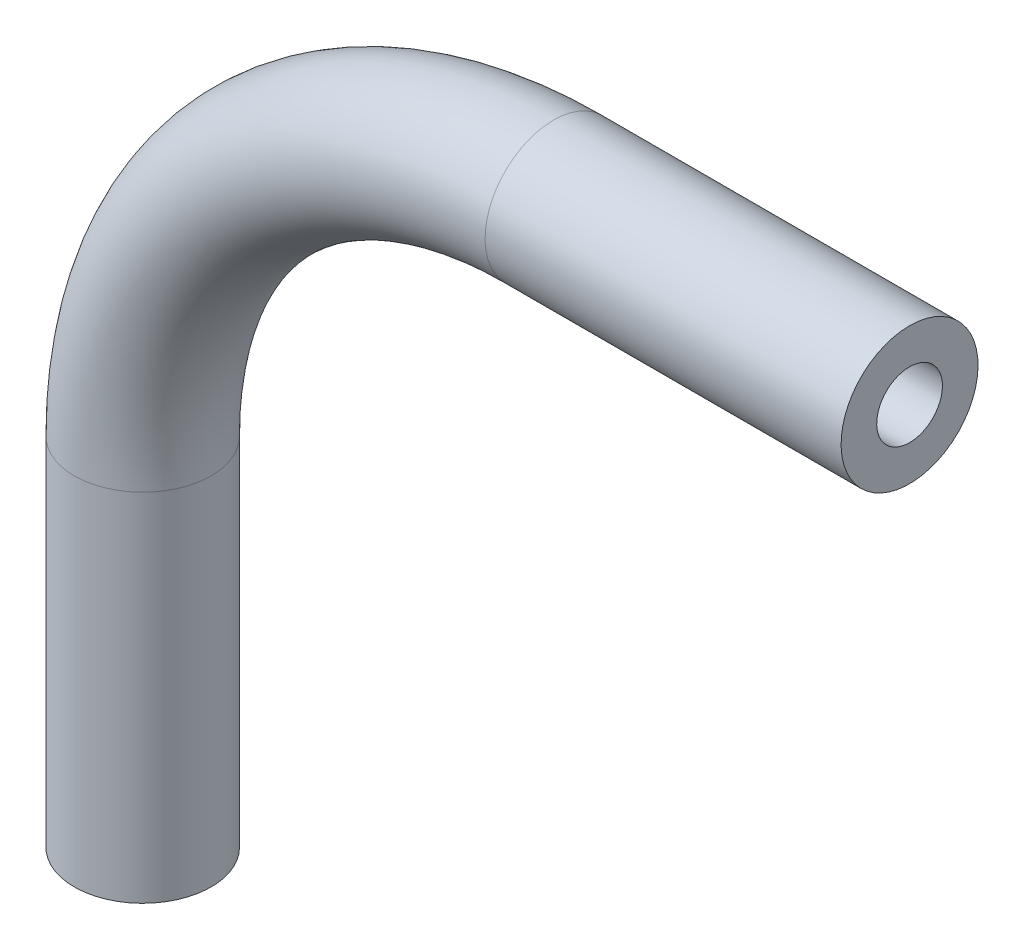
ISO-10303-21;
HEADER;
FILE_DESCRIPTION(('STEP AP214'),'2;1');
FILE_NAME('part.step','',(''),(''),'','','');
FILE_SCHEMA(('AUTOMOTIVE_DESIGN { 1 0 10303 214 1 1 1 1 }'));
ENDSEC;
DATA;
#1=APPLICATION_CONTEXT('core data for automotive mechanical design processes');
#2=APPLICATION_PROTOCOL_DEFINITION('international standard','automotive_design',2000,#1);
#3=PRODUCT_CONTEXT('',#1,'mechanical');
#4=PRODUCT('Part','Part','',(#3));
#5=PRODUCT_RELATED_PRODUCT_CATEGORY('part','',(#4));
#6=PRODUCT_DEFINITION_FORMATION('','',#4);
#7=PRODUCT_DEFINITION_CONTEXT('part definition',#1,'design');
#8=PRODUCT_DEFINITION('design','',#6,#7);
#9=PRODUCT_DEFINITION_SHAPE('','',#8);
#10=(LENGTH_UNIT() NAMED_UNIT(*) SI_UNIT(.MILLI.,.METRE.));
#11=(NAMED_UNIT(*) PLANE_ANGLE_UNIT() SI_UNIT($,.RADIAN.));
#12=(NAMED_UNIT(*) SI_UNIT($,.STERADIAN.) SOLID_ANGLE_UNIT());
#13=UNCERTAINTY_MEASURE_WITH_UNIT(LENGTH_MEASURE(1.E-05),#10,'distance_accuracy_value','');
#14=(GEOMETRIC_REPRESENTATION_CONTEXT(3) GLOBAL_UNCERTAINTY_ASSIGNED_CONTEXT((#13)) GLOBAL_UNIT_ASSIGNED_CONTEXT((#10,
#11,#12)) REPRESENTATION_CONTEXT('',''));
#15=CARTESIAN_POINT('',(0.,0.,0.));
#16=DIRECTION('',(0.,0.,1.));
#17=DIRECTION('',(1.,0.,0.));
#18=AXIS2_PLACEMENT_3D('',#15,#16,#17);
#19=CARTESIAN_POINT('',(0.,-18.0323178807946,0.));
#20=DIRECTION('',(0.,1.,0.));
#21=DIRECTION('',(-1.,0.,0.));
#22=AXIS2_PLACEMENT_3D('',#19,#20,#21);
#23=CYLINDRICAL_SURFACE('',#22,3.175);
#24=CARTESIAN_POINT('',(0.,-1.52231788079484,0.));
#25=DIRECTION('',(0.,1.,0.));
#26=DIRECTION('',(-1.,0.,0.));
#27=AXIS2_PLACEMENT_3D('',#24,#25,#26);
#28=CIRCLE('',#27,3.175);
#29=CARTESIAN_POINT('',(-3.175,-1.52231788079487,0.));
#30=VERTEX_POINT('',#29);
#31=EDGE_CURVE('E80',#30,#30,#28,.T.);
#32=ORIENTED_EDGE('',*,*,#31,.F.);
#33=EDGE_LOOP('',(#32));
#34=FACE_BOUND('',#33,.T.);
#35=CARTESIAN_POINT('',(0.,-18.0323178807946,0.));
#36=DIRECTION('',(0.,1.,0.));
#37=DIRECTION('',(-1.,0.,0.));
#38=AXIS2_PLACEMENT_3D('',#35,#36,#37);
#39=CIRCLE('',#38,3.175);
#40=CARTESIAN_POINT('',(-3.175,-18.0323178807946,0.));
#41=VERTEX_POINT('',#40);
#42=EDGE_CURVE('E49',#41,#41,#39,.T.);
#43=ORIENTED_EDGE('',*,*,#42,.T.);
#44=EDGE_LOOP('',(#43));
#45=FACE_BOUND('',#44,.T.);
#46=ADVANCED_FACE('F34',(#34,#45),#23,.T.);
#47=CARTESIAN_POINT('',(19.05,-1.52231788079469,0.));
#48=DIRECTION('',(0.,0.,-1.));
#49=DIRECTION('',(-1.,0.,0.));
#50=AXIS2_PLACEMENT_3D('',#47,#48,#49);
#51=TOROIDAL_SURFACE('',#50,19.05,3.175);
#52=CARTESIAN_POINT('',(19.0500000000001,17.5276821192053,0.));
#53=DIRECTION('',(1.,0.,0.));
#54=DIRECTION('',(0.,1.,0.));
#55=AXIS2_PLACEMENT_3D('',#52,#53,#54);
#56=CIRCLE('',#55,3.175);
#57=CARTESIAN_POINT('',(19.0500000000001,20.7026821192053,0.));
#58=VERTEX_POINT('',#57);
#59=EDGE_CURVE('E38',#58,#58,#56,.T.);
#60=CARTESIAN_POINT('',(19.05,-1.52231788079469,0.));
#61=DIRECTION('',(0.,0.,-1.));
#62=DIRECTION('',(-1.,0.,0.));
#63=AXIS2_PLACEMENT_3D('',#60,#61,#62);
#64=CIRCLE('',#63,22.225);
#65=EDGE_CURVE('',#30,#58,#64,.T.);
#66=ORIENTED_EDGE('',*,*,#31,.T.);
#67=ORIENTED_EDGE('',*,*,#59,.F.);
#68=ORIENTED_EDGE('',*,*,#65,.T.);
#69=ORIENTED_EDGE('',*,*,#65,.F.);
#70=EDGE_LOOP('',(#66,#68,#67,#69));
#71=FACE_BOUND('',#70,.T.);
#72=ADVANCED_FACE('F88',(#71),#51,.T.);
#73=CARTESIAN_POINT('',(19.0500000000001,17.5276821192053,0.));
#74=DIRECTION('',(1.,0.,0.));
#75=DIRECTION('',(0.,1.,0.));
#76=AXIS2_PLACEMENT_3D('',#73,#74,#75);
#77=CYLINDRICAL_SURFACE('',#76,3.175);
#78=CARTESIAN_POINT('',(35.56,17.5276821192053,0.));
#79=DIRECTION('',(1.,0.,0.));
#80=DIRECTION('',(0.,1.,0.));
#81=AXIS2_PLACEMENT_3D('',#78,#79,#80);
#82=CIRCLE('',#81,3.175);
#83=CARTESIAN_POINT('',(35.56,20.7026821192053,0.));
#84=VERTEX_POINT('',#83);
#85=EDGE_CURVE('E54',#84,#84,#82,.T.);
#86=ORIENTED_EDGE('',*,*,#85,.F.);
#87=EDGE_LOOP('',(#86));
#88=FACE_BOUND('',#87,.T.);
#89=ORIENTED_EDGE('',*,*,#59,.T.);
#90=EDGE_LOOP('',(#89));
#91=FACE_BOUND('',#90,.T.);
#92=ADVANCED_FACE('F36',(#88,#91),#77,.T.);
#93=CARTESIAN_POINT('',(0.,-18.0323178807946,0.));
#94=DIRECTION('',(0.,1.,0.));
#95=DIRECTION('',(-1.,0.,0.));
#96=AXIS2_PLACEMENT_3D('',#93,#94,#95);
#97=PLANE('',#96);
#98=CARTESIAN_POINT('',(0.,-18.0323178807946,0.));
#99=DIRECTION('',(0.,1.,0.));
#100=DIRECTION('',(-1.,0.,0.));
#101=AXIS2_PLACEMENT_3D('',#98,#99,#100);
#102=CIRCLE('',#101,1.524);
#103=CARTESIAN_POINT('',(-1.524,-18.0323178807946,0.));
#104=VERTEX_POINT('',#103);
#105=EDGE_CURVE('E75',#104,#104,#102,.F.);
#106=ORIENTED_EDGE('',*,*,#105,.F.);
#107=EDGE_LOOP('',(#106));
#108=FACE_BOUND('',#107,.T.);
#109=ORIENTED_EDGE('',*,*,#42,.F.);
#110=EDGE_LOOP('',(#109));
#111=FACE_BOUND('',#110,.T.);
#112=ADVANCED_FACE('F94',(#108,#111),#97,.F.);
#113=CARTESIAN_POINT('',(35.56,17.5276821192053,0.));
#114=DIRECTION('',(1.,0.,0.));
#115=DIRECTION('',(0.,1.,0.));
#116=AXIS2_PLACEMENT_3D('',#113,#114,#115);
#117=PLANE('',#116);
#118=CARTESIAN_POINT('',(35.56,17.5276821192053,0.));
#119=DIRECTION('',(1.,0.,0.));
#120=DIRECTION('',(0.,1.,0.));
#121=AXIS2_PLACEMENT_3D('',#118,#119,#120);
#122=CIRCLE('',#121,1.524);
#123=CARTESIAN_POINT('',(35.56,19.0516821192053,0.));
#124=VERTEX_POINT('',#123);
#125=EDGE_CURVE('E11',#124,#124,#122,.F.);
#126=ORIENTED_EDGE('',*,*,#125,.T.);
#127=EDGE_LOOP('',(#126));
#128=FACE_BOUND('',#127,.T.);
#129=ORIENTED_EDGE('',*,*,#85,.T.);
#130=EDGE_LOOP('',(#129));
#131=FACE_BOUND('',#130,.T.);
#132=ADVANCED_FACE('F61',(#128,#131),#117,.T.);
#133=CARTESIAN_POINT('',(0.,-18.0323178807946,0.));
#134=DIRECTION('',(0.,1.,0.));
#135=DIRECTION('',(-1.,0.,0.));
#136=AXIS2_PLACEMENT_3D('',#133,#134,#135);
#137=CYLINDRICAL_SURFACE('',#136,1.524);
#138=CARTESIAN_POINT('',(0.,-1.52231788079484,0.));
#139=DIRECTION('',(0.,1.,0.));
#140=DIRECTION('',(-1.,0.,0.));
#141=AXIS2_PLACEMENT_3D('',#138,#139,#140);
#142=CIRCLE('',#141,1.524);
#143=CARTESIAN_POINT('',(-1.524,-1.52231788079485,0.));
#144=VERTEX_POINT('',#143);
#145=EDGE_CURVE('E72',#144,#144,#142,.F.);
#146=ORIENTED_EDGE('',*,*,#145,.F.);
#147=EDGE_LOOP('',(#146));
#148=FACE_BOUND('',#147,.T.);
#149=ORIENTED_EDGE('',*,*,#105,.T.);
#150=EDGE_LOOP('',(#149));
#151=FACE_BOUND('',#150,.T.);
#152=ADVANCED_FACE('F102',(#148,#151),#137,.F.);
#153=CARTESIAN_POINT('',(19.05,-1.52231788079469,0.));
#154=DIRECTION('',(0.,0.,-1.));
#155=DIRECTION('',(-1.,0.,0.));
#156=AXIS2_PLACEMENT_3D('',#153,#154,#155);
#157=TOROIDAL_SURFACE('',#156,19.05,1.524);
#158=CARTESIAN_POINT('',(19.0500000000001,17.5276821192053,0.));
#159=DIRECTION('',(1.,0.,0.));
#160=DIRECTION('',(0.,1.,0.));
#161=AXIS2_PLACEMENT_3D('',#158,#159,#160);
#162=CIRCLE('',#161,1.524);
#163=CARTESIAN_POINT('',(19.0500000000001,19.0516821192053,0.));
#164=VERTEX_POINT('',#163);
#165=EDGE_CURVE('E43',#164,#164,#162,.F.);
#166=CARTESIAN_POINT('',(19.05,-1.52231788079469,0.));
#167=DIRECTION('',(0.,0.,-1.));
#168=DIRECTION('',(-1.,0.,0.));
#169=AXIS2_PLACEMENT_3D('',#166,#167,#168);
#170=CIRCLE('',#169,20.574);
#171=EDGE_CURVE('',#144,#164,#170,.T.);
#172=ORIENTED_EDGE('',*,*,#145,.T.);
#173=ORIENTED_EDGE('',*,*,#165,.F.);
#174=ORIENTED_EDGE('',*,*,#171,.T.);
#175=ORIENTED_EDGE('',*,*,#171,.F.);
#176=EDGE_LOOP('',(#172,#174,#173,#175));
#177=FACE_BOUND('',#176,.T.);
#178=ADVANCED_FACE('F67',(#177),#157,.F.);
#179=CARTESIAN_POINT('',(19.0500000000001,17.5276821192053,0.));
#180=DIRECTION('',(1.,0.,0.));
#181=DIRECTION('',(0.,1.,0.));
#182=AXIS2_PLACEMENT_3D('',#179,#180,#181);
#183=CYLINDRICAL_SURFACE('',#182,1.524);
#184=ORIENTED_EDGE('',*,*,#125,.F.);
#185=EDGE_LOOP('',(#184));
#186=FACE_BOUND('',#185,.T.);
#187=ORIENTED_EDGE('',*,*,#165,.T.);
#188=EDGE_LOOP('',(#187));
#189=FACE_BOUND('',#188,.T.);
#190=ADVANCED_FACE('F64',(#186,#189),#183,.F.);
#191=CLOSED_SHELL('',(#46,#72,#92,#112,#132,#152,#178,#190));
#192=MANIFOLD_SOLID_BREP('B2',#191);
#193=ADVANCED_BREP_SHAPE_REPRESENTATION('',(#18,#192),#14);
#194=SHAPE_DEFINITION_REPRESENTATION(#9,#193);
ENDSEC;
END-ISO-10303-21;
